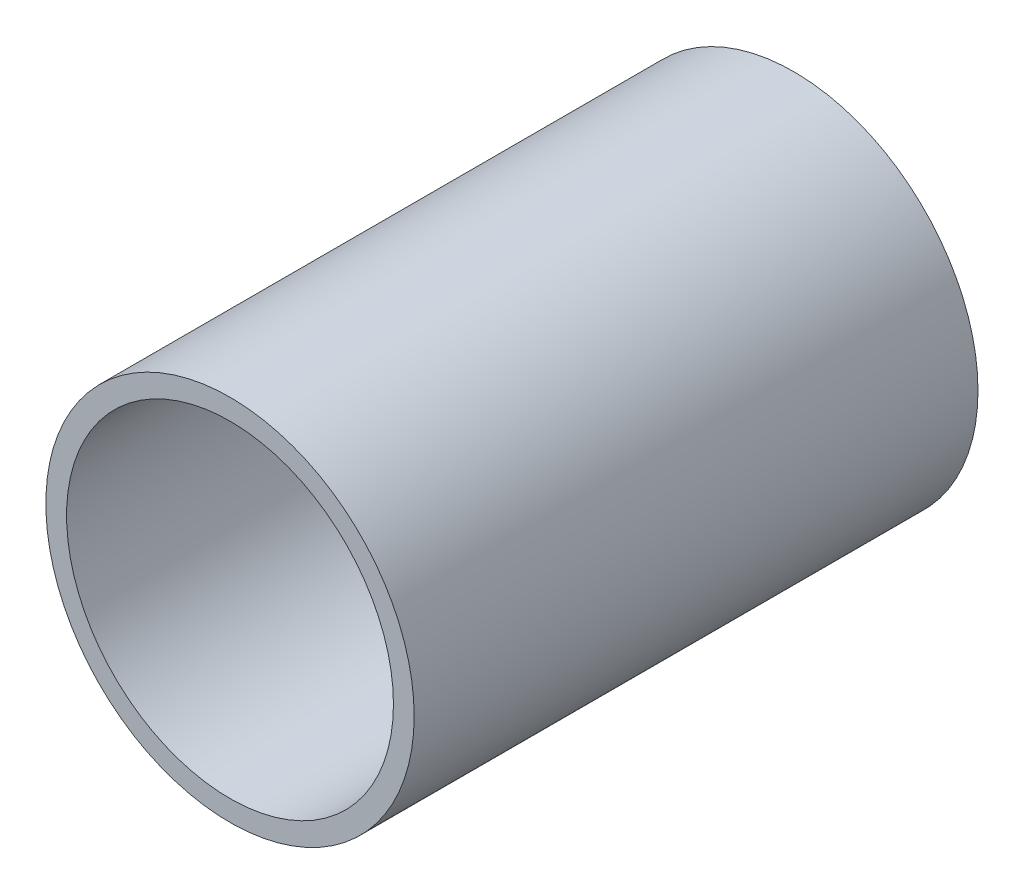
ISO-10303-21;
HEADER;
FILE_DESCRIPTION(('STEP AP214'),'2;1');
FILE_NAME('part.step','',(''),(''),'','','');
FILE_SCHEMA(('AUTOMOTIVE_DESIGN { 1 0 10303 214 1 1 1 1 }'));
ENDSEC;
DATA;
#1=APPLICATION_CONTEXT('core data for automotive mechanical design processes');
#2=APPLICATION_PROTOCOL_DEFINITION('international standard','automotive_design',2000,#1);
#3=PRODUCT_CONTEXT('',#1,'mechanical');
#4=PRODUCT('Part','Part','',(#3));
#5=PRODUCT_RELATED_PRODUCT_CATEGORY('part','',(#4));
#6=PRODUCT_DEFINITION_FORMATION('','',#4);
#7=PRODUCT_DEFINITION_CONTEXT('part definition',#1,'design');
#8=PRODUCT_DEFINITION('design','',#6,#7);
#9=PRODUCT_DEFINITION_SHAPE('','',#8);
#10=(LENGTH_UNIT() NAMED_UNIT(*) SI_UNIT(.MILLI.,.METRE.));
#11=(NAMED_UNIT(*) PLANE_ANGLE_UNIT() SI_UNIT($,.RADIAN.));
#12=(NAMED_UNIT(*) SI_UNIT($,.STERADIAN.) SOLID_ANGLE_UNIT());
#13=UNCERTAINTY_MEASURE_WITH_UNIT(LENGTH_MEASURE(1.E-05),#10,'distance_accuracy_value','');
#14=(GEOMETRIC_REPRESENTATION_CONTEXT(3) GLOBAL_UNCERTAINTY_ASSIGNED_CONTEXT((#13)) GLOBAL_UNIT_ASSIGNED_CONTEXT((#10,
#11,#12)) REPRESENTATION_CONTEXT('',''));
#15=CARTESIAN_POINT('',(0.,0.,0.));
#16=DIRECTION('',(0.,0.,1.));
#17=DIRECTION('',(1.,0.,0.));
#18=AXIS2_PLACEMENT_3D('',#15,#16,#17);
#19=CARTESIAN_POINT('',(0.,0.,50.8));
#20=DIRECTION('',(0.,0.,1.));
#21=DIRECTION('',(1.,0.,0.));
#22=AXIS2_PLACEMENT_3D('',#19,#20,#21);
#23=PLANE('',#22);
#24=CARTESIAN_POINT('',(0.,0.,50.8));
#25=DIRECTION('',(0.,0.,1.));
#26=DIRECTION('',(1.,0.,0.));
#27=AXIS2_PLACEMENT_3D('',#24,#25,#26);
#28=CIRCLE('',#27,16.59255);
#29=CARTESIAN_POINT('',(16.59255,0.,50.8));
#30=VERTEX_POINT('',#29);
#31=EDGE_CURVE('E10',#30,#30,#28,.T.);
#32=ORIENTED_EDGE('',*,*,#31,.T.);
#33=EDGE_LOOP('',(#32));
#34=FACE_BOUND('',#33,.T.);
#35=CARTESIAN_POINT('',(0.,0.,50.8));
#36=DIRECTION('',(0.,0.,1.));
#37=DIRECTION('',(1.,0.,0.));
#38=AXIS2_PLACEMENT_3D('',#35,#36,#37);
#39=CIRCLE('',#38,14.72565);
#40=CARTESIAN_POINT('',(14.72565,0.,50.8));
#41=VERTEX_POINT('',#40);
#42=EDGE_CURVE('E41',#41,#41,#39,.T.);
#43=ORIENTED_EDGE('',*,*,#42,.F.);
#44=EDGE_LOOP('',(#43));
#45=FACE_BOUND('',#44,.T.);
#46=ADVANCED_FACE('F30',(#34,#45),#23,.T.);
#47=CARTESIAN_POINT('',(0.,0.,0.));
#48=DIRECTION('',(0.,0.,1.));
#49=DIRECTION('',(1.,0.,0.));
#50=AXIS2_PLACEMENT_3D('',#47,#48,#49);
#51=PLANE('',#50);
#52=CARTESIAN_POINT('',(0.,0.,0.));
#53=DIRECTION('',(0.,0.,1.));
#54=DIRECTION('',(1.,0.,0.));
#55=AXIS2_PLACEMENT_3D('',#52,#53,#54);
#56=CIRCLE('',#55,16.59255);
#57=CARTESIAN_POINT('',(16.59255,0.,0.));
#58=VERTEX_POINT('',#57);
#59=EDGE_CURVE('E34',#58,#58,#56,.T.);
#60=ORIENTED_EDGE('',*,*,#59,.F.);
#61=EDGE_LOOP('',(#60));
#62=FACE_BOUND('',#61,.T.);
#63=CARTESIAN_POINT('',(0.,0.,0.));
#64=DIRECTION('',(0.,0.,1.));
#65=DIRECTION('',(1.,0.,0.));
#66=AXIS2_PLACEMENT_3D('',#63,#64,#65);
#67=CIRCLE('',#66,14.72565);
#68=CARTESIAN_POINT('',(14.72565,0.,0.));
#69=VERTEX_POINT('',#68);
#70=EDGE_CURVE('E43',#69,#69,#67,.T.);
#71=ORIENTED_EDGE('',*,*,#70,.T.);
#72=EDGE_LOOP('',(#71));
#73=FACE_BOUND('',#72,.T.);
#74=ADVANCED_FACE('F53',(#62,#73),#51,.F.);
#75=CARTESIAN_POINT('',(0.,0.,50.8));
#76=DIRECTION('',(0.,0.,-1.));
#77=DIRECTION('',(-1.,0.,0.));
#78=AXIS2_PLACEMENT_3D('',#75,#76,#77);
#79=CYLINDRICAL_SURFACE('',#78,16.59255);
#80=ORIENTED_EDGE('',*,*,#31,.F.);
#81=EDGE_LOOP('',(#80));
#82=FACE_BOUND('',#81,.T.);
#83=ORIENTED_EDGE('',*,*,#59,.T.);
#84=EDGE_LOOP('',(#83));
#85=FACE_BOUND('',#84,.T.);
#86=ADVANCED_FACE('F32',(#82,#85),#79,.T.);
#87=CARTESIAN_POINT('',(0.,0.,50.8));
#88=DIRECTION('',(0.,0.,-1.));
#89=DIRECTION('',(-1.,0.,0.));
#90=AXIS2_PLACEMENT_3D('',#87,#88,#89);
#91=CYLINDRICAL_SURFACE('',#90,14.72565);
#92=ORIENTED_EDGE('',*,*,#42,.T.);
#93=EDGE_LOOP('',(#92));
#94=FACE_BOUND('',#93,.T.);
#95=ORIENTED_EDGE('',*,*,#70,.F.);
#96=EDGE_LOOP('',(#95));
#97=FACE_BOUND('',#96,.T.);
#98=ADVANCED_FACE('F49',(#94,#97),#91,.F.);
#99=CLOSED_SHELL('',(#46,#74,#86,#98));
#100=MANIFOLD_SOLID_BREP('B2',#99);
#101=ADVANCED_BREP_SHAPE_REPRESENTATION('',(#18,#100),#14);
#102=SHAPE_DEFINITION_REPRESENTATION(#9,#101);
ENDSEC;
END-ISO-10303-21;
